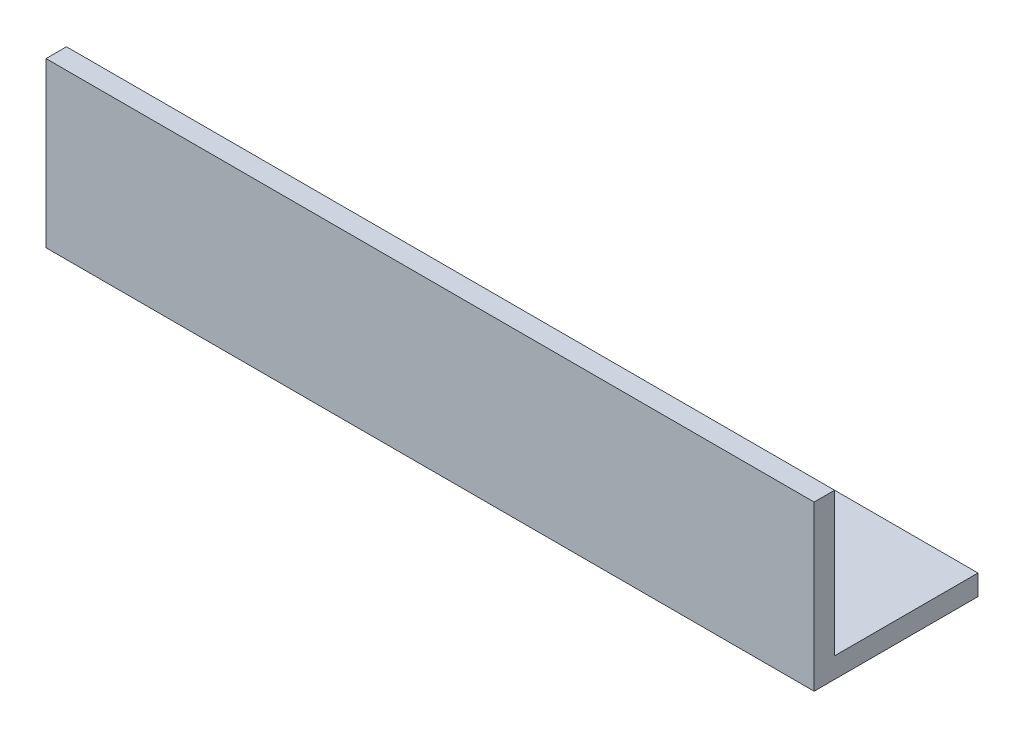
ISO-10303-21;
HEADER;
FILE_DESCRIPTION(('STEP AP214'),'2;1');
FILE_NAME('part.step','',(''),(''),'','','');
FILE_SCHEMA(('AUTOMOTIVE_DESIGN { 1 0 10303 214 1 1 1 1 }'));
ENDSEC;
DATA;
#1=APPLICATION_CONTEXT('core data for automotive mechanical design processes');
#2=APPLICATION_PROTOCOL_DEFINITION('international standard','automotive_design',2000,#1);
#3=PRODUCT_CONTEXT('',#1,'mechanical');
#4=PRODUCT('Part','Part','',(#3));
#5=PRODUCT_RELATED_PRODUCT_CATEGORY('part','',(#4));
#6=PRODUCT_DEFINITION_FORMATION('','',#4);
#7=PRODUCT_DEFINITION_CONTEXT('part definition',#1,'design');
#8=PRODUCT_DEFINITION('design','',#6,#7);
#9=PRODUCT_DEFINITION_SHAPE('','',#8);
#10=(LENGTH_UNIT() NAMED_UNIT(*) SI_UNIT(.MILLI.,.METRE.));
#11=(NAMED_UNIT(*) PLANE_ANGLE_UNIT() SI_UNIT($,.RADIAN.));
#12=(NAMED_UNIT(*) SI_UNIT($,.STERADIAN.) SOLID_ANGLE_UNIT());
#13=UNCERTAINTY_MEASURE_WITH_UNIT(LENGTH_MEASURE(1.E-05),#10,'distance_accuracy_value','');
#14=(GEOMETRIC_REPRESENTATION_CONTEXT(3) GLOBAL_UNCERTAINTY_ASSIGNED_CONTEXT((#13)) GLOBAL_UNIT_ASSIGNED_CONTEXT((#10,
#11,#12)) REPRESENTATION_CONTEXT('',''));
#15=CARTESIAN_POINT('',(0.,0.,0.));
#16=DIRECTION('',(0.,0.,1.));
#17=DIRECTION('',(1.,0.,0.));
#18=AXIS2_PLACEMENT_3D('',#15,#16,#17);
#19=CARTESIAN_POINT('',(150.,0.,0.));
#20=DIRECTION('',(0.,1.,0.));
#21=DIRECTION('',(0.,0.,1.));
#22=AXIS2_PLACEMENT_3D('',#19,#20,#21);
#23=PLANE('',#22);
#24=CARTESIAN_POINT('',(19.9999999999995,0.,-13.));
#25=DIRECTION('',(0.,-1.,0.));
#26=DIRECTION('',(0.,0.,1.));
#27=AXIS2_PLACEMENT_3D('',#24,#25,#26);
#28=CIRCLE('',#27,4.99999999999999);
#29=CARTESIAN_POINT('',(19.9999999999995,0.,-8.00000000000001));
#30=VERTEX_POINT('',#29);
#31=EDGE_CURVE('E153',#30,#30,#28,.T.);
#32=ORIENTED_EDGE('',*,*,#31,.F.);
#33=EDGE_LOOP('',(#32));
#34=FACE_BOUND('',#33,.T.);
#35=CARTESIAN_POINT('',(49.9999999999995,0.,-13.0000000000002));
#36=DIRECTION('',(0.,-1.,0.));
#37=DIRECTION('',(0.,0.,1.));
#38=AXIS2_PLACEMENT_3D('',#35,#36,#37);
#39=CIRCLE('',#38,4.99999999999999);
#40=CARTESIAN_POINT('',(49.9999999999995,0.,-8.00000000000022));
#41=VERTEX_POINT('',#40);
#42=EDGE_CURVE('E143',#41,#41,#39,.T.);
#43=ORIENTED_EDGE('',*,*,#42,.F.);
#44=EDGE_LOOP('',(#43));
#45=FACE_BOUND('',#44,.T.);
#46=CARTESIAN_POINT('',(100.,0.,-13.0000000000002));
#47=DIRECTION('',(0.,-1.,0.));
#48=DIRECTION('',(0.,0.,-1.));
#49=AXIS2_PLACEMENT_3D('',#46,#47,#48);
#50=CIRCLE('',#49,4.99999999999999);
#51=CARTESIAN_POINT('',(100.,0.,-18.0000000000002));
#52=VERTEX_POINT('',#51);
#53=EDGE_CURVE('E140',#52,#52,#50,.T.);
#54=ORIENTED_EDGE('',*,*,#53,.F.);
#55=EDGE_LOOP('',(#54));
#56=FACE_BOUND('',#55,.T.);
#57=CARTESIAN_POINT('',(130.,0.,-13.));
#58=DIRECTION('',(0.,-1.,0.));
#59=DIRECTION('',(0.,0.,-1.));
#60=AXIS2_PLACEMENT_3D('',#57,#58,#59);
#61=CIRCLE('',#60,4.99999999999999);
#62=CARTESIAN_POINT('',(130.,0.,-18.));
#63=VERTEX_POINT('',#62);
#64=EDGE_CURVE('E137',#63,#63,#61,.T.);
#65=ORIENTED_EDGE('',*,*,#64,.F.);
#66=EDGE_LOOP('',(#65));
#67=FACE_BOUND('',#66,.T.);
#68=DIRECTION('',(0.,0.,-1.));
#69=VECTOR('',#68,1.);
#70=CARTESIAN_POINT('',(0.,0.,0.));
#71=LINE('',#70,#69);
#72=CARTESIAN_POINT('',(0.,0.,0.));
#73=VERTEX_POINT('',#72);
#74=CARTESIAN_POINT('',(0.,0.,-32.));
#75=VERTEX_POINT('',#74);
#76=EDGE_CURVE('E117',#73,#75,#71,.T.);
#77=ORIENTED_EDGE('',*,*,#76,.T.);
#78=DIRECTION('',(-1.,0.,0.));
#79=VECTOR('',#78,1.);
#80=CARTESIAN_POINT('',(150.,0.,-32.));
#81=LINE('',#80,#79);
#82=CARTESIAN_POINT('',(150.,0.,-32.));
#83=VERTEX_POINT('',#82);
#84=EDGE_CURVE('E11',#83,#75,#81,.T.);
#85=ORIENTED_EDGE('',*,*,#84,.F.);
#86=DIRECTION('',(0.,0.,-1.));
#87=VECTOR('',#86,1.);
#88=CARTESIAN_POINT('',(150.,0.,0.));
#89=LINE('',#88,#87);
#90=CARTESIAN_POINT('',(150.,0.,0.));
#91=VERTEX_POINT('',#90);
#92=EDGE_CURVE('E82',#91,#83,#89,.T.);
#93=ORIENTED_EDGE('',*,*,#92,.F.);
#94=DIRECTION('',(-1.,0.,0.));
#95=VECTOR('',#94,1.);
#96=CARTESIAN_POINT('',(150.,0.,0.));
#97=LINE('',#96,#95);
#98=EDGE_CURVE('E113',#91,#73,#97,.T.);
#99=ORIENTED_EDGE('',*,*,#98,.T.);
#100=EDGE_LOOP('',(#77,#85,#93,#99));
#101=FACE_BOUND('',#100,.T.);
#102=ADVANCED_FACE('F34',(#34,#45,#56,#67,#101),#23,.F.);
#103=CARTESIAN_POINT('',(150.,4.,-32.));
#104=DIRECTION('',(0.,0.,-1.));
#105=DIRECTION('',(-1.,0.,0.));
#106=AXIS2_PLACEMENT_3D('',#103,#104,#105);
#107=PLANE('',#106);
#108=DIRECTION('',(0.,-1.,0.));
#109=VECTOR('',#108,1.);
#110=CARTESIAN_POINT('',(0.,4.,-32.));
#111=LINE('',#110,#109);
#112=CARTESIAN_POINT('',(0.,4.,-32.));
#113=VERTEX_POINT('',#112);
#114=EDGE_CURVE('E120',#113,#75,#111,.T.);
#115=ORIENTED_EDGE('',*,*,#114,.F.);
#116=DIRECTION('',(-1.,0.,0.));
#117=VECTOR('',#116,1.);
#118=CARTESIAN_POINT('',(150.,4.,-32.));
#119=LINE('',#118,#117);
#120=CARTESIAN_POINT('',(150.,4.,-32.));
#121=VERTEX_POINT('',#120);
#122=EDGE_CURVE('E43',#121,#113,#119,.T.);
#123=ORIENTED_EDGE('',*,*,#122,.F.);
#124=DIRECTION('',(0.,-1.,0.));
#125=VECTOR('',#124,1.);
#126=CARTESIAN_POINT('',(150.,4.,-32.));
#127=LINE('',#126,#125);
#128=EDGE_CURVE('E159',#121,#83,#127,.T.);
#129=ORIENTED_EDGE('',*,*,#128,.T.);
#130=ORIENTED_EDGE('',*,*,#84,.T.);
#131=EDGE_LOOP('',(#115,#123,#129,#130));
#132=FACE_BOUND('',#131,.T.);
#133=ADVANCED_FACE('F180',(#132),#107,.T.);
#134=CARTESIAN_POINT('',(150.,4.,0.));
#135=DIRECTION('',(0.,1.,0.));
#136=DIRECTION('',(0.,0.,1.));
#137=AXIS2_PLACEMENT_3D('',#134,#135,#136);
#138=PLANE('',#137);
#139=CARTESIAN_POINT('',(19.9999999999995,4.,-13.));
#140=DIRECTION('',(0.,1.,0.));
#141=DIRECTION('',(0.,0.,1.));
#142=AXIS2_PLACEMENT_3D('',#139,#140,#141);
#143=CIRCLE('',#142,4.99999999999999);
#144=CARTESIAN_POINT('',(19.9999999999995,4.,-8.00000000000001));
#145=VERTEX_POINT('',#144);
#146=EDGE_CURVE('E37',#145,#145,#143,.T.);
#147=ORIENTED_EDGE('',*,*,#146,.F.);
#148=EDGE_LOOP('',(#147));
#149=FACE_BOUND('',#148,.T.);
#150=CARTESIAN_POINT('',(49.9999999999995,4.,-13.0000000000002));
#151=DIRECTION('',(0.,1.,0.));
#152=DIRECTION('',(0.,0.,1.));
#153=AXIS2_PLACEMENT_3D('',#150,#151,#152);
#154=CIRCLE('',#153,4.99999999999999);
#155=CARTESIAN_POINT('',(49.9999999999995,4.,-8.00000000000022));
#156=VERTEX_POINT('',#155);
#157=EDGE_CURVE('E141',#156,#156,#154,.T.);
#158=ORIENTED_EDGE('',*,*,#157,.F.);
#159=EDGE_LOOP('',(#158));
#160=FACE_BOUND('',#159,.T.);
#161=CARTESIAN_POINT('',(100.,4.,-13.0000000000002));
#162=DIRECTION('',(0.,1.,0.));
#163=DIRECTION('',(0.,0.,1.));
#164=AXIS2_PLACEMENT_3D('',#161,#162,#163);
#165=CIRCLE('',#164,4.99999999999999);
#166=CARTESIAN_POINT('',(100.,4.,-8.00000000000022));
#167=VERTEX_POINT('',#166);
#168=EDGE_CURVE('E138',#167,#167,#165,.T.);
#169=ORIENTED_EDGE('',*,*,#168,.F.);
#170=EDGE_LOOP('',(#169));
#171=FACE_BOUND('',#170,.T.);
#172=CARTESIAN_POINT('',(130.,4.,-13.));
#173=DIRECTION('',(0.,1.,0.));
#174=DIRECTION('',(0.,0.,1.));
#175=AXIS2_PLACEMENT_3D('',#172,#173,#174);
#176=CIRCLE('',#175,4.99999999999999);
#177=CARTESIAN_POINT('',(130.,4.,-8.00000000000001));
#178=VERTEX_POINT('',#177);
#179=EDGE_CURVE('E121',#178,#178,#176,.T.);
#180=ORIENTED_EDGE('',*,*,#179,.F.);
#181=EDGE_LOOP('',(#180));
#182=FACE_BOUND('',#181,.T.);
#183=DIRECTION('',(0.,0.,-1.));
#184=VECTOR('',#183,1.);
#185=CARTESIAN_POINT('',(0.,4.,0.));
#186=LINE('',#185,#184);
#187=CARTESIAN_POINT('',(0.,4.,-4.));
#188=VERTEX_POINT('',#187);
#189=EDGE_CURVE('E124',#188,#113,#186,.T.);
#190=ORIENTED_EDGE('',*,*,#189,.F.);
#191=DIRECTION('',(-1.,0.,0.));
#192=VECTOR('',#191,1.);
#193=CARTESIAN_POINT('',(150.,4.,-4.));
#194=LINE('',#193,#192);
#195=CARTESIAN_POINT('',(150.,4.,-4.));
#196=VERTEX_POINT('',#195);
#197=EDGE_CURVE('E103',#196,#188,#194,.T.);
#198=ORIENTED_EDGE('',*,*,#197,.F.);
#199=DIRECTION('',(0.,0.,-1.));
#200=VECTOR('',#199,1.);
#201=CARTESIAN_POINT('',(150.,4.,0.));
#202=LINE('',#201,#200);
#203=EDGE_CURVE('E109',#196,#121,#202,.T.);
#204=ORIENTED_EDGE('',*,*,#203,.T.);
#205=ORIENTED_EDGE('',*,*,#122,.T.);
#206=EDGE_LOOP('',(#190,#198,#204,#205));
#207=FACE_BOUND('',#206,.T.);
#208=ADVANCED_FACE('F163',(#149,#160,#171,#182,#207),#138,.T.);
#209=CARTESIAN_POINT('',(150.,0.,-4.));
#210=DIRECTION('',(0.,0.,-1.));
#211=DIRECTION('',(-1.,0.,0.));
#212=AXIS2_PLACEMENT_3D('',#209,#210,#211);
#213=PLANE('',#212);
#214=DIRECTION('',(0.,1.,0.));
#215=VECTOR('',#214,1.);
#216=CARTESIAN_POINT('',(0.,0.,-4.));
#217=LINE('',#216,#215);
#218=CARTESIAN_POINT('',(0.,32.,-4.));
#219=VERTEX_POINT('',#218);
#220=EDGE_CURVE('E98',#219,#188,#217,.F.);
#221=ORIENTED_EDGE('',*,*,#220,.F.);
#222=DIRECTION('',(-1.,0.,0.));
#223=VECTOR('',#222,1.);
#224=CARTESIAN_POINT('',(150.,32.,-4.));
#225=LINE('',#224,#223);
#226=CARTESIAN_POINT('',(150.,32.,-4.));
#227=VERTEX_POINT('',#226);
#228=EDGE_CURVE('E93',#227,#219,#225,.T.);
#229=ORIENTED_EDGE('',*,*,#228,.F.);
#230=DIRECTION('',(0.,1.,0.));
#231=VECTOR('',#230,1.);
#232=CARTESIAN_POINT('',(150.,0.,-4.));
#233=LINE('',#232,#231);
#234=EDGE_CURVE('E96',#227,#196,#233,.F.);
#235=ORIENTED_EDGE('',*,*,#234,.T.);
#236=ORIENTED_EDGE('',*,*,#197,.T.);
#237=EDGE_LOOP('',(#221,#229,#235,#236));
#238=FACE_BOUND('',#237,.T.);
#239=ADVANCED_FACE('F95',(#238),#213,.T.);
#240=CARTESIAN_POINT('',(150.,32.,0.));
#241=DIRECTION('',(0.,1.,0.));
#242=DIRECTION('',(0.,0.,1.));
#243=AXIS2_PLACEMENT_3D('',#240,#241,#242);
#244=PLANE('',#243);
#245=DIRECTION('',(0.,0.,-1.));
#246=VECTOR('',#245,1.);
#247=CARTESIAN_POINT('',(0.,32.,0.));
#248=LINE('',#247,#246);
#249=CARTESIAN_POINT('',(0.,32.,0.));
#250=VERTEX_POINT('',#249);
#251=EDGE_CURVE('E128',#250,#219,#248,.T.);
#252=ORIENTED_EDGE('',*,*,#251,.F.);
#253=DIRECTION('',(-1.,0.,0.));
#254=VECTOR('',#253,1.);
#255=CARTESIAN_POINT('',(150.,32.,0.));
#256=LINE('',#255,#254);
#257=CARTESIAN_POINT('',(150.,32.,0.));
#258=VERTEX_POINT('',#257);
#259=EDGE_CURVE('E73',#258,#250,#256,.T.);
#260=ORIENTED_EDGE('',*,*,#259,.F.);
#261=DIRECTION('',(0.,0.,-1.));
#262=VECTOR('',#261,1.);
#263=CARTESIAN_POINT('',(150.,32.,0.));
#264=LINE('',#263,#262);
#265=EDGE_CURVE('E107',#258,#227,#264,.T.);
#266=ORIENTED_EDGE('',*,*,#265,.T.);
#267=ORIENTED_EDGE('',*,*,#228,.T.);
#268=EDGE_LOOP('',(#252,#260,#266,#267));
#269=FACE_BOUND('',#268,.T.);
#270=ADVANCED_FACE('F111',(#269),#244,.T.);
#271=CARTESIAN_POINT('',(150.,0.,0.));
#272=DIRECTION('',(0.,0.,-1.));
#273=DIRECTION('',(-1.,0.,0.));
#274=AXIS2_PLACEMENT_3D('',#271,#272,#273);
#275=PLANE('',#274);
#276=DIRECTION('',(0.,-1.,0.));
#277=VECTOR('',#276,1.);
#278=CARTESIAN_POINT('',(0.,0.,0.));
#279=LINE('',#278,#277);
#280=EDGE_CURVE('E76',#250,#73,#279,.T.);
#281=ORIENTED_EDGE('',*,*,#280,.T.);
#282=ORIENTED_EDGE('',*,*,#98,.F.);
#283=DIRECTION('',(0.,-1.,0.));
#284=VECTOR('',#283,1.);
#285=CARTESIAN_POINT('',(150.,0.,0.));
#286=LINE('',#285,#284);
#287=EDGE_CURVE('E52',#258,#91,#286,.T.);
#288=ORIENTED_EDGE('',*,*,#287,.F.);
#289=ORIENTED_EDGE('',*,*,#259,.T.);
#290=EDGE_LOOP('',(#281,#282,#288,#289));
#291=FACE_BOUND('',#290,.T.);
#292=ADVANCED_FACE('F169',(#291),#275,.F.);
#293=CARTESIAN_POINT('',(150.,0.,0.));
#294=DIRECTION('',(-1.,0.,0.));
#295=DIRECTION('',(0.,0.,1.));
#296=AXIS2_PLACEMENT_3D('',#293,#294,#295);
#297=PLANE('',#296);
#298=ORIENTED_EDGE('',*,*,#92,.T.);
#299=ORIENTED_EDGE('',*,*,#128,.F.);
#300=ORIENTED_EDGE('',*,*,#203,.F.);
#301=ORIENTED_EDGE('',*,*,#234,.F.);
#302=ORIENTED_EDGE('',*,*,#265,.F.);
#303=ORIENTED_EDGE('',*,*,#287,.T.);
#304=EDGE_LOOP('',(#298,#299,#300,#301,#302,#303));
#305=FACE_BOUND('',#304,.T.);
#306=ADVANCED_FACE('F106',(#305),#297,.F.);
#307=CARTESIAN_POINT('',(0.,0.,0.));
#308=DIRECTION('',(-1.,0.,0.));
#309=DIRECTION('',(0.,0.,1.));
#310=AXIS2_PLACEMENT_3D('',#307,#308,#309);
#311=PLANE('',#310);
#312=ORIENTED_EDGE('',*,*,#76,.F.);
#313=ORIENTED_EDGE('',*,*,#280,.F.);
#314=ORIENTED_EDGE('',*,*,#251,.T.);
#315=ORIENTED_EDGE('',*,*,#220,.T.);
#316=ORIENTED_EDGE('',*,*,#189,.T.);
#317=ORIENTED_EDGE('',*,*,#114,.T.);
#318=EDGE_LOOP('',(#312,#313,#314,#315,#316,#317));
#319=FACE_BOUND('',#318,.T.);
#320=ADVANCED_FACE('F167',(#319),#311,.T.);
#321=CARTESIAN_POINT('',(130.,32.,-13.));
#322=DIRECTION('',(0.,-1.,0.));
#323=DIRECTION('',(0.,0.,-1.));
#324=AXIS2_PLACEMENT_3D('',#321,#322,#323);
#325=CYLINDRICAL_SURFACE('',#324,4.99999999999999);
#326=ORIENTED_EDGE('',*,*,#179,.T.);
#327=EDGE_LOOP('',(#326));
#328=FACE_BOUND('',#327,.T.);
#329=ORIENTED_EDGE('',*,*,#64,.T.);
#330=EDGE_LOOP('',(#329));
#331=FACE_BOUND('',#330,.T.);
#332=ADVANCED_FACE('F194',(#328,#331),#325,.F.);
#333=CARTESIAN_POINT('',(100.,32.,-13.0000000000002));
#334=DIRECTION('',(0.,-1.,0.));
#335=DIRECTION('',(0.,0.,-1.));
#336=AXIS2_PLACEMENT_3D('',#333,#334,#335);
#337=CYLINDRICAL_SURFACE('',#336,4.99999999999999);
#338=ORIENTED_EDGE('',*,*,#168,.T.);
#339=EDGE_LOOP('',(#338));
#340=FACE_BOUND('',#339,.T.);
#341=ORIENTED_EDGE('',*,*,#53,.T.);
#342=EDGE_LOOP('',(#341));
#343=FACE_BOUND('',#342,.T.);
#344=ADVANCED_FACE('F196',(#340,#343),#337,.F.);
#345=CARTESIAN_POINT('',(49.9999999999995,32.,-13.0000000000002));
#346=DIRECTION('',(0.,-1.,0.));
#347=DIRECTION('',(0.,0.,-1.));
#348=AXIS2_PLACEMENT_3D('',#345,#346,#347);
#349=CYLINDRICAL_SURFACE('',#348,4.99999999999999);
#350=ORIENTED_EDGE('',*,*,#157,.T.);
#351=EDGE_LOOP('',(#350));
#352=FACE_BOUND('',#351,.T.);
#353=ORIENTED_EDGE('',*,*,#42,.T.);
#354=EDGE_LOOP('',(#353));
#355=FACE_BOUND('',#354,.T.);
#356=ADVANCED_FACE('F203',(#352,#355),#349,.F.);
#357=CARTESIAN_POINT('',(19.9999999999995,32.,-13.));
#358=DIRECTION('',(0.,-1.,0.));
#359=DIRECTION('',(0.,0.,-1.));
#360=AXIS2_PLACEMENT_3D('',#357,#358,#359);
#361=CYLINDRICAL_SURFACE('',#360,4.99999999999999);
#362=ORIENTED_EDGE('',*,*,#146,.T.);
#363=EDGE_LOOP('',(#362));
#364=FACE_BOUND('',#363,.T.);
#365=ORIENTED_EDGE('',*,*,#31,.T.);
#366=EDGE_LOOP('',(#365));
#367=FACE_BOUND('',#366,.T.);
#368=ADVANCED_FACE('F209',(#364,#367),#361,.F.);
#369=CLOSED_SHELL('',(#102,#133,#208,#239,#270,#292,#306,#320,#332,#344,#356,#368));
#370=MANIFOLD_SOLID_BREP('B2',#369);
#371=ADVANCED_BREP_SHAPE_REPRESENTATION('',(#18,#370),#14);
#372=SHAPE_DEFINITION_REPRESENTATION(#9,#371);
ENDSEC;
END-ISO-10303-21;
